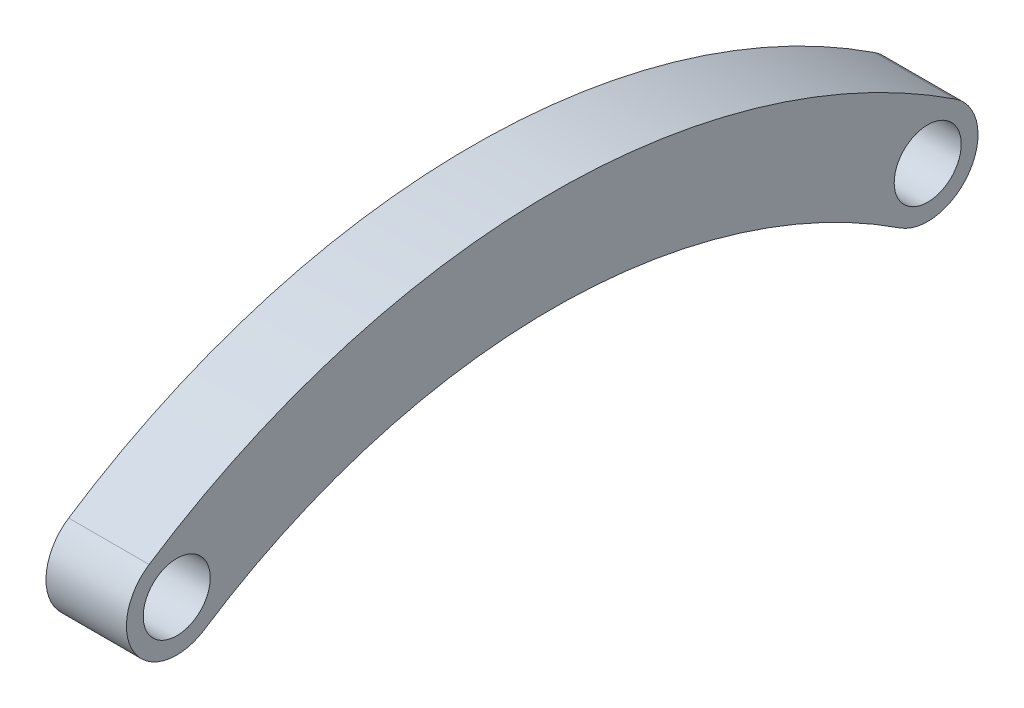
ISO-10303-21;
HEADER;
FILE_DESCRIPTION(('STEP AP214'),'2;1');
FILE_NAME('part.step','',(''),(''),'','','');
FILE_SCHEMA(('AUTOMOTIVE_DESIGN { 1 0 10303 214 1 1 1 1 }'));
ENDSEC;
DATA;
#1=APPLICATION_CONTEXT('core data for automotive mechanical design processes');
#2=APPLICATION_PROTOCOL_DEFINITION('international standard','automotive_design',2000,#1);
#3=PRODUCT_CONTEXT('',#1,'mechanical');
#4=PRODUCT('Part','Part','',(#3));
#5=PRODUCT_RELATED_PRODUCT_CATEGORY('part','',(#4));
#6=PRODUCT_DEFINITION_FORMATION('','',#4);
#7=PRODUCT_DEFINITION_CONTEXT('part definition',#1,'design');
#8=PRODUCT_DEFINITION('design','',#6,#7);
#9=PRODUCT_DEFINITION_SHAPE('','',#8);
#10=(LENGTH_UNIT() NAMED_UNIT(*) SI_UNIT(.MILLI.,.METRE.));
#11=(NAMED_UNIT(*) PLANE_ANGLE_UNIT() SI_UNIT($,.RADIAN.));
#12=(NAMED_UNIT(*) SI_UNIT($,.STERADIAN.) SOLID_ANGLE_UNIT());
#13=UNCERTAINTY_MEASURE_WITH_UNIT(LENGTH_MEASURE(1.E-05),#10,'distance_accuracy_value','');
#14=(GEOMETRIC_REPRESENTATION_CONTEXT(3) GLOBAL_UNCERTAINTY_ASSIGNED_CONTEXT((#13)) GLOBAL_UNIT_ASSIGNED_CONTEXT((#10,
#11,#12)) REPRESENTATION_CONTEXT('',''));
#15=CARTESIAN_POINT('',(0.,0.,0.));
#16=DIRECTION('',(0.,0.,1.));
#17=DIRECTION('',(1.,0.,0.));
#18=AXIS2_PLACEMENT_3D('',#15,#16,#17);
#19=CARTESIAN_POINT('',(2.399999953,-3.69999999999996,-22.4));
#20=DIRECTION('',(-1.,0.,0.));
#21=DIRECTION('',(0.,0.,1.));
#22=AXIS2_PLACEMENT_3D('',#19,#20,#21);
#23=CYLINDRICAL_SURFACE('',#22,3.);
#24=CARTESIAN_POINT('',(-2.399999953,-3.69999999999996,-22.4));
#25=DIRECTION('',(1.,0.,0.));
#26=DIRECTION('',(0.,0.,-1.));
#27=AXIS2_PLACEMENT_3D('',#24,#25,#26);
#28=CIRCLE('',#27,3.);
#29=CARTESIAN_POINT('',(-2.399999953,-6.20728985639803,-20.7527302661666));
#30=VERTEX_POINT('',#29);
#31=CARTESIAN_POINT('',(-2.399999953,-1.19271014360174,-24.0472697338334));
#32=VERTEX_POINT('',#31);
#33=EDGE_CURVE('E100',#30,#32,#28,.T.);
#34=ORIENTED_EDGE('',*,*,#33,.T.);
#35=DIRECTION('',(-1.,0.,0.));
#36=VECTOR('',#35,1.);
#37=CARTESIAN_POINT('',(2.399999953,-1.19271014360174,-24.0472697338334));
#38=LINE('',#37,#36);
#39=CARTESIAN_POINT('',(2.399999953,-1.19271014360174,-24.0472697338334));
#40=VERTEX_POINT('',#39);
#41=EDGE_CURVE('E11',#40,#32,#38,.T.);
#42=ORIENTED_EDGE('',*,*,#41,.F.);
#43=CARTESIAN_POINT('',(2.399999953,-3.69999999999996,-22.4));
#44=DIRECTION('',(1.,0.,0.));
#45=DIRECTION('',(0.,0.,-1.));
#46=AXIS2_PLACEMENT_3D('',#43,#44,#45);
#47=CIRCLE('',#46,3.);
#48=CARTESIAN_POINT('',(2.399999953,-6.20728985639803,-20.7527302661666));
#49=VERTEX_POINT('',#48);
#50=EDGE_CURVE('E86',#49,#40,#47,.T.);
#51=ORIENTED_EDGE('',*,*,#50,.F.);
#52=DIRECTION('',(-1.,0.,0.));
#53=VECTOR('',#52,1.);
#54=CARTESIAN_POINT('',(2.399999953,-6.20728985639803,-20.7527302661666));
#55=LINE('',#54,#53);
#56=EDGE_CURVE('E96',#49,#30,#55,.T.);
#57=ORIENTED_EDGE('',*,*,#56,.T.);
#58=EDGE_LOOP('',(#34,#42,#51,#57));
#59=FACE_BOUND('',#58,.T.);
#60=ADVANCED_FACE('F36',(#59),#23,.T.);
#61=CARTESIAN_POINT('',(2.399999953,-37.7947761194029,0.));
#62=DIRECTION('',(-1.,0.,0.));
#63=DIRECTION('',(0.,0.,1.));
#64=AXIS2_PLACEMENT_3D('',#61,#62,#63);
#65=CYLINDRICAL_SURFACE('',#64,43.7947761194032);
#66=CARTESIAN_POINT('',(-2.399999953,-37.7947761194029,0.));
#67=DIRECTION('',(1.,0.,0.));
#68=DIRECTION('',(0.,0.,-1.));
#69=AXIS2_PLACEMENT_3D('',#66,#67,#68);
#70=CIRCLE('',#69,43.7947761194032);
#71=CARTESIAN_POINT('',(-2.399999953,-1.1927101436019,24.0472697338333));
#72=VERTEX_POINT('',#71);
#73=EDGE_CURVE('E91',#32,#72,#70,.T.);
#74=ORIENTED_EDGE('',*,*,#73,.T.);
#75=DIRECTION('',(-1.,0.,0.));
#76=VECTOR('',#75,1.);
#77=CARTESIAN_POINT('',(2.399999953,-1.1927101436019,24.0472697338333));
#78=LINE('',#77,#76);
#79=CARTESIAN_POINT('',(2.399999953,-1.1927101436019,24.0472697338333));
#80=VERTEX_POINT('',#79);
#81=EDGE_CURVE('E44',#80,#72,#78,.T.);
#82=ORIENTED_EDGE('',*,*,#81,.F.);
#83=CARTESIAN_POINT('',(2.399999953,-37.7947761194029,0.));
#84=DIRECTION('',(1.,0.,0.));
#85=DIRECTION('',(0.,0.,1.));
#86=AXIS2_PLACEMENT_3D('',#83,#84,#85);
#87=CIRCLE('',#86,43.7947761194032);
#88=EDGE_CURVE('E80',#40,#80,#87,.T.);
#89=ORIENTED_EDGE('',*,*,#88,.F.);
#90=ORIENTED_EDGE('',*,*,#41,.T.);
#91=EDGE_LOOP('',(#74,#82,#89,#90));
#92=FACE_BOUND('',#91,.T.);
#93=ADVANCED_FACE('F90',(#92),#65,.T.);
#94=CARTESIAN_POINT('',(2.399999953,-3.69999999999996,22.4));
#95=DIRECTION('',(-1.,0.,0.));
#96=DIRECTION('',(0.,0.,1.));
#97=AXIS2_PLACEMENT_3D('',#94,#95,#96);
#98=CYLINDRICAL_SURFACE('',#97,3.);
#99=CARTESIAN_POINT('',(-2.399999953,-3.69999999999996,22.4));
#100=DIRECTION('',(1.,0.,0.));
#101=DIRECTION('',(0.,0.,1.));
#102=AXIS2_PLACEMENT_3D('',#99,#100,#101);
#103=CIRCLE('',#102,3.);
#104=CARTESIAN_POINT('',(-2.399999953,-6.20728985639803,20.7527302661666));
#105=VERTEX_POINT('',#104);
#106=EDGE_CURVE('E105',#72,#105,#103,.T.);
#107=ORIENTED_EDGE('',*,*,#106,.T.);
#108=DIRECTION('',(-1.,0.,0.));
#109=VECTOR('',#108,1.);
#110=CARTESIAN_POINT('',(2.399999953,-6.20728985639803,20.7527302661666));
#111=LINE('',#110,#109);
#112=CARTESIAN_POINT('',(2.399999953,-6.20728985639803,20.7527302661666));
#113=VERTEX_POINT('',#112);
#114=EDGE_CURVE('E93',#113,#105,#111,.T.);
#115=ORIENTED_EDGE('',*,*,#114,.F.);
#116=CARTESIAN_POINT('',(2.399999953,-3.69999999999996,22.4));
#117=DIRECTION('',(1.,0.,0.));
#118=DIRECTION('',(0.,0.,1.));
#119=AXIS2_PLACEMENT_3D('',#116,#117,#118);
#120=CIRCLE('',#119,3.);
#121=EDGE_CURVE('E83',#80,#113,#120,.T.);
#122=ORIENTED_EDGE('',*,*,#121,.F.);
#123=ORIENTED_EDGE('',*,*,#81,.T.);
#124=EDGE_LOOP('',(#107,#115,#122,#123));
#125=FACE_BOUND('',#124,.T.);
#126=ADVANCED_FACE('F94',(#125),#98,.T.);
#127=CARTESIAN_POINT('',(2.399999953,-37.7947761194029,0.));
#128=DIRECTION('',(-1.,0.,0.));
#129=DIRECTION('',(0.,0.,1.));
#130=AXIS2_PLACEMENT_3D('',#127,#128,#129);
#131=CYLINDRICAL_SURFACE('',#130,37.794776119403);
#132=CARTESIAN_POINT('',(-2.399999953,-37.7947761194029,0.));
#133=DIRECTION('',(-1.,0.,0.));
#134=DIRECTION('',(0.,0.,1.));
#135=AXIS2_PLACEMENT_3D('',#132,#133,#134);
#136=CIRCLE('',#135,37.794776119403);
#137=EDGE_CURVE('E69',#105,#30,#136,.T.);
#138=ORIENTED_EDGE('',*,*,#137,.T.);
#139=ORIENTED_EDGE('',*,*,#56,.F.);
#140=CARTESIAN_POINT('',(2.399999953,-37.7947761194029,0.));
#141=DIRECTION('',(-1.,0.,0.));
#142=DIRECTION('',(0.,0.,-1.));
#143=AXIS2_PLACEMENT_3D('',#140,#141,#142);
#144=CIRCLE('',#143,37.794776119403);
#145=EDGE_CURVE('E52',#113,#49,#144,.T.);
#146=ORIENTED_EDGE('',*,*,#145,.F.);
#147=ORIENTED_EDGE('',*,*,#114,.T.);
#148=EDGE_LOOP('',(#138,#139,#146,#147));
#149=FACE_BOUND('',#148,.T.);
#150=ADVANCED_FACE('F109',(#149),#131,.F.);
#151=CARTESIAN_POINT('',(2.399999953,-20.7473880597014,-11.2));
#152=DIRECTION('',(1.,0.,0.));
#153=DIRECTION('',(0.,0.,-1.));
#154=AXIS2_PLACEMENT_3D('',#151,#152,#153);
#155=PLANE('',#154);
#156=CARTESIAN_POINT('',(2.399999953,-3.69999999999996,22.4));
#157=DIRECTION('',(1.,0.,0.));
#158=DIRECTION('',(0.,0.,-1.));
#159=AXIS2_PLACEMENT_3D('',#156,#157,#158);
#160=CIRCLE('',#159,2.);
#161=CARTESIAN_POINT('',(2.399999953,-3.69999999999996,20.4));
#162=VERTEX_POINT('',#161);
#163=EDGE_CURVE('E115',#162,#162,#160,.T.);
#164=ORIENTED_EDGE('',*,*,#163,.F.);
#165=EDGE_LOOP('',(#164));
#166=FACE_BOUND('',#165,.T.);
#167=CARTESIAN_POINT('',(2.399999953,-3.69999999999996,-22.4));
#168=DIRECTION('',(1.,0.,0.));
#169=DIRECTION('',(0.,0.,1.));
#170=AXIS2_PLACEMENT_3D('',#167,#168,#169);
#171=CIRCLE('',#170,2.);
#172=CARTESIAN_POINT('',(2.399999953,-3.69999999999996,-20.4));
#173=VERTEX_POINT('',#172);
#174=EDGE_CURVE('E112',#173,#173,#171,.T.);
#175=ORIENTED_EDGE('',*,*,#174,.F.);
#176=EDGE_LOOP('',(#175));
#177=FACE_BOUND('',#176,.T.);
#178=ORIENTED_EDGE('',*,*,#50,.T.);
#179=ORIENTED_EDGE('',*,*,#88,.T.);
#180=ORIENTED_EDGE('',*,*,#121,.T.);
#181=ORIENTED_EDGE('',*,*,#145,.T.);
#182=EDGE_LOOP('',(#178,#179,#180,#181));
#183=FACE_BOUND('',#182,.T.);
#184=ADVANCED_FACE('F81',(#166,#177,#183),#155,.T.);
#185=CARTESIAN_POINT('',(-2.399999953,-20.7473880597014,-11.2));
#186=DIRECTION('',(1.,0.,0.));
#187=DIRECTION('',(0.,0.,-1.));
#188=AXIS2_PLACEMENT_3D('',#185,#186,#187);
#189=PLANE('',#188);
#190=CARTESIAN_POINT('',(-2.399999953,-3.69999999999996,22.4));
#191=DIRECTION('',(1.,0.,0.));
#192=DIRECTION('',(0.,0.,-1.));
#193=AXIS2_PLACEMENT_3D('',#190,#191,#192);
#194=CIRCLE('',#193,2.);
#195=CARTESIAN_POINT('',(-2.399999953,-3.69999999999996,20.4));
#196=VERTEX_POINT('',#195);
#197=EDGE_CURVE('E103',#196,#196,#194,.F.);
#198=ORIENTED_EDGE('',*,*,#197,.F.);
#199=EDGE_LOOP('',(#198));
#200=FACE_BOUND('',#199,.T.);
#201=CARTESIAN_POINT('',(-2.399999953,-3.69999999999996,-22.4));
#202=DIRECTION('',(1.,0.,0.));
#203=DIRECTION('',(0.,0.,-1.));
#204=AXIS2_PLACEMENT_3D('',#201,#202,#203);
#205=CIRCLE('',#204,2.);
#206=CARTESIAN_POINT('',(-2.399999953,-3.69999999999996,-24.4));
#207=VERTEX_POINT('',#206);
#208=EDGE_CURVE('E116',#207,#207,#205,.F.);
#209=ORIENTED_EDGE('',*,*,#208,.F.);
#210=EDGE_LOOP('',(#209));
#211=FACE_BOUND('',#210,.T.);
#212=ORIENTED_EDGE('',*,*,#33,.F.);
#213=ORIENTED_EDGE('',*,*,#137,.F.);
#214=ORIENTED_EDGE('',*,*,#106,.F.);
#215=ORIENTED_EDGE('',*,*,#73,.F.);
#216=EDGE_LOOP('',(#212,#213,#214,#215));
#217=FACE_BOUND('',#216,.T.);
#218=ADVANCED_FACE('F128',(#200,#211,#217),#189,.F.);
#219=CARTESIAN_POINT('',(-8.05685420249239,-3.69999999999996,-22.4));
#220=DIRECTION('',(1.,0.,0.));
#221=DIRECTION('',(0.,0.,-1.));
#222=AXIS2_PLACEMENT_3D('',#219,#220,#221);
#223=CYLINDRICAL_SURFACE('',#222,2.);
#224=ORIENTED_EDGE('',*,*,#208,.T.);
#225=EDGE_LOOP('',(#224));
#226=FACE_BOUND('',#225,.T.);
#227=ORIENTED_EDGE('',*,*,#174,.T.);
#228=EDGE_LOOP('',(#227));
#229=FACE_BOUND('',#228,.T.);
#230=ADVANCED_FACE('F132',(#226,#229),#223,.F.);
#231=CARTESIAN_POINT('',(-8.05685420249239,-3.69999999999996,22.4));
#232=DIRECTION('',(1.,0.,0.));
#233=DIRECTION('',(0.,0.,-1.));
#234=AXIS2_PLACEMENT_3D('',#231,#232,#233);
#235=CYLINDRICAL_SURFACE('',#234,2.);
#236=ORIENTED_EDGE('',*,*,#197,.T.);
#237=EDGE_LOOP('',(#236));
#238=FACE_BOUND('',#237,.T.);
#239=ORIENTED_EDGE('',*,*,#163,.T.);
#240=EDGE_LOOP('',(#239));
#241=FACE_BOUND('',#240,.T.);
#242=ADVANCED_FACE('F124',(#238,#241),#235,.F.);
#243=CLOSED_SHELL('',(#60,#93,#126,#150,#184,#218,#230,#242));
#244=MANIFOLD_SOLID_BREP('B2',#243);
#245=ADVANCED_BREP_SHAPE_REPRESENTATION('',(#18,#244),#14);
#246=SHAPE_DEFINITION_REPRESENTATION(#9,#245);
ENDSEC;
END-ISO-10303-21;
